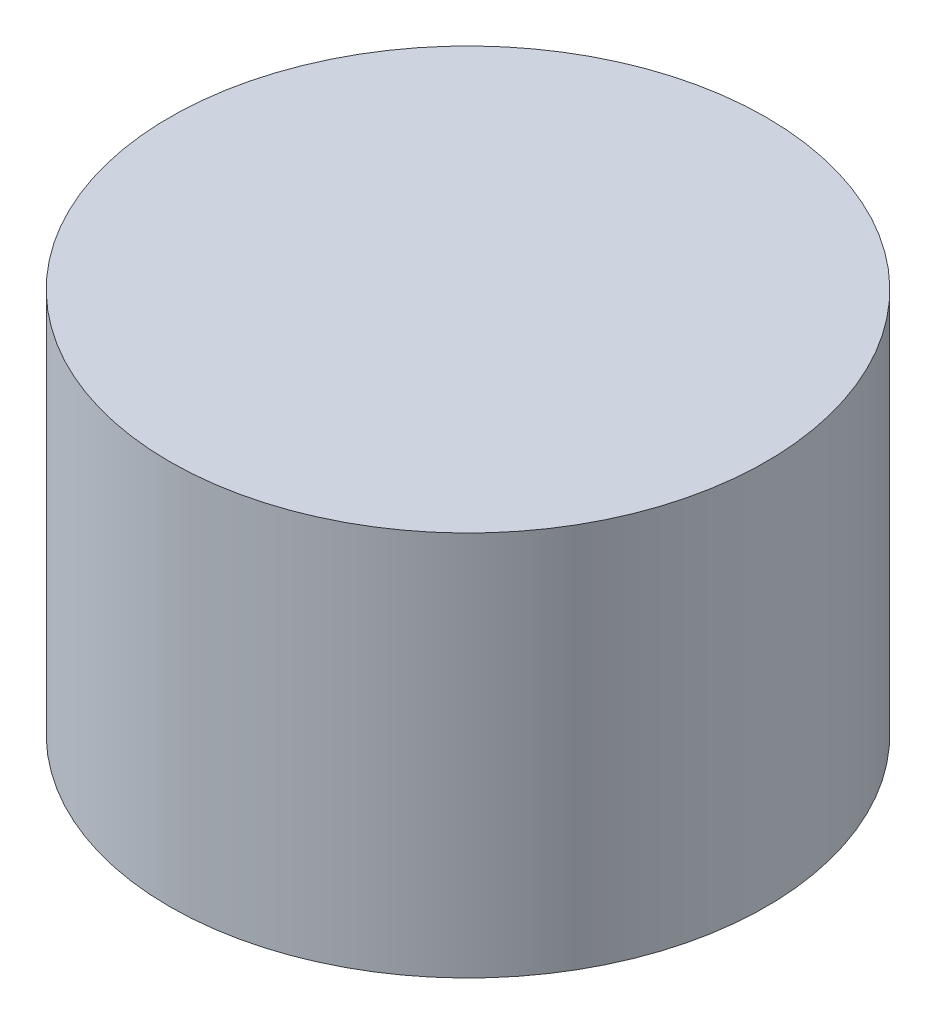
ISO-10303-21;
HEADER;
FILE_DESCRIPTION(('STEP AP214'),'2;1');
FILE_NAME('part.step','',(''),(''),'','','');
FILE_SCHEMA(('AUTOMOTIVE_DESIGN { 1 0 10303 214 1 1 1 1 }'));
ENDSEC;
DATA;
#1=APPLICATION_CONTEXT('core data for automotive mechanical design processes');
#2=APPLICATION_PROTOCOL_DEFINITION('international standard','automotive_design',2000,#1);
#3=PRODUCT_CONTEXT('',#1,'mechanical');
#4=PRODUCT('Part','Part','',(#3));
#5=PRODUCT_RELATED_PRODUCT_CATEGORY('part','',(#4));
#6=PRODUCT_DEFINITION_FORMATION('','',#4);
#7=PRODUCT_DEFINITION_CONTEXT('part definition',#1,'design');
#8=PRODUCT_DEFINITION('design','',#6,#7);
#9=PRODUCT_DEFINITION_SHAPE('','',#8);
#10=(LENGTH_UNIT() NAMED_UNIT(*) SI_UNIT(.MILLI.,.METRE.));
#11=(NAMED_UNIT(*) PLANE_ANGLE_UNIT() SI_UNIT($,.RADIAN.));
#12=(NAMED_UNIT(*) SI_UNIT($,.STERADIAN.) SOLID_ANGLE_UNIT());
#13=UNCERTAINTY_MEASURE_WITH_UNIT(LENGTH_MEASURE(1.E-05),#10,'distance_accuracy_value','');
#14=(GEOMETRIC_REPRESENTATION_CONTEXT(3) GLOBAL_UNCERTAINTY_ASSIGNED_CONTEXT((#13)) GLOBAL_UNIT_ASSIGNED_CONTEXT((#10,
#11,#12)) REPRESENTATION_CONTEXT('',''));
#15=CARTESIAN_POINT('',(0.,0.,0.));
#16=DIRECTION('',(0.,0.,1.));
#17=DIRECTION('',(1.,0.,0.));
#18=AXIS2_PLACEMENT_3D('',#15,#16,#17);
#19=CARTESIAN_POINT('',(0.,6.35,0.));
#20=DIRECTION('',(0.,-1.,0.));
#21=DIRECTION('',(0.,0.,-1.));
#22=AXIS2_PLACEMENT_3D('',#19,#20,#21);
#23=CYLINDRICAL_SURFACE('',#22,4.914519);
#24=CARTESIAN_POINT('',(0.,6.35,0.));
#25=DIRECTION('',(0.,1.,0.));
#26=DIRECTION('',(0.,0.,1.));
#27=AXIS2_PLACEMENT_3D('',#24,#25,#26);
#28=CIRCLE('',#27,4.914519);
#29=CARTESIAN_POINT('',(0.,6.35,4.914519));
#30=VERTEX_POINT('',#29);
#31=EDGE_CURVE('E10',#30,#30,#28,.T.);
#32=ORIENTED_EDGE('',*,*,#31,.F.);
#33=EDGE_LOOP('',(#32));
#34=FACE_BOUND('',#33,.T.);
#35=CARTESIAN_POINT('',(0.,0.,0.));
#36=DIRECTION('',(0.,1.,0.));
#37=DIRECTION('',(0.,0.,1.));
#38=AXIS2_PLACEMENT_3D('',#35,#36,#37);
#39=CIRCLE('',#38,4.914519);
#40=CARTESIAN_POINT('',(0.,0.,4.914519));
#41=VERTEX_POINT('',#40);
#42=EDGE_CURVE('E40',#41,#41,#39,.T.);
#43=ORIENTED_EDGE('',*,*,#42,.T.);
#44=EDGE_LOOP('',(#43));
#45=FACE_BOUND('',#44,.T.);
#46=ADVANCED_FACE('F37',(#34,#45),#23,.T.);
#47=CARTESIAN_POINT('',(0.,6.35,0.));
#48=DIRECTION('',(0.,1.,0.));
#49=DIRECTION('',(0.,0.,1.));
#50=AXIS2_PLACEMENT_3D('',#47,#48,#49);
#51=PLANE('',#50);
#52=ORIENTED_EDGE('',*,*,#31,.T.);
#53=EDGE_LOOP('',(#52));
#54=FACE_BOUND('',#53,.T.);
#55=ADVANCED_FACE('F54',(#54),#51,.T.);
#56=CARTESIAN_POINT('',(0.,0.,0.));
#57=DIRECTION('',(0.,1.,0.));
#58=DIRECTION('',(0.,0.,1.));
#59=AXIS2_PLACEMENT_3D('',#56,#57,#58);
#60=PLANE('',#59);
#61=ORIENTED_EDGE('',*,*,#42,.F.);
#62=EDGE_LOOP('',(#61));
#63=FACE_BOUND('',#62,.T.);
#64=ADVANCED_FACE('F52',(#63),#60,.F.);
#65=CLOSED_SHELL('',(#46,#55,#64));
#66=MANIFOLD_SOLID_BREP('B2',#65);
#67=ADVANCED_BREP_SHAPE_REPRESENTATION('',(#18,#66),#14);
#68=SHAPE_DEFINITION_REPRESENTATION(#9,#67);
ENDSEC;
END-ISO-10303-21;
